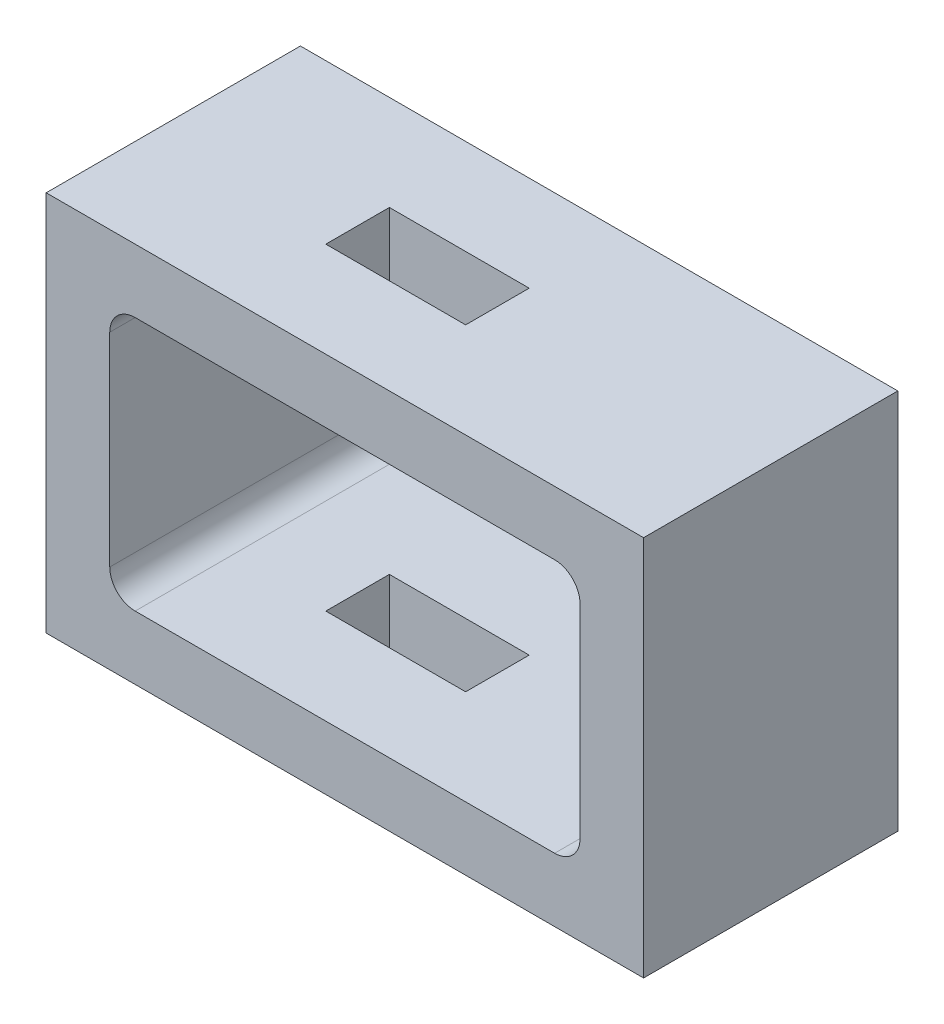
ISO-10303-21;
HEADER;
FILE_DESCRIPTION(('STEP AP214'),'2;1');
FILE_NAME('part.step','',(''),(''),'','','');
FILE_SCHEMA(('AUTOMOTIVE_DESIGN { 1 0 10303 214 1 1 1 1 }'));
ENDSEC;
DATA;
#1=APPLICATION_CONTEXT('core data for automotive mechanical design processes');
#2=APPLICATION_PROTOCOL_DEFINITION('international standard','automotive_design',2000,#1);
#3=PRODUCT_CONTEXT('',#1,'mechanical');
#4=PRODUCT('Part','Part','',(#3));
#5=PRODUCT_RELATED_PRODUCT_CATEGORY('part','',(#4));
#6=PRODUCT_DEFINITION_FORMATION('','',#4);
#7=PRODUCT_DEFINITION_CONTEXT('part definition',#1,'design');
#8=PRODUCT_DEFINITION('design','',#6,#7);
#9=PRODUCT_DEFINITION_SHAPE('','',#8);
#10=(LENGTH_UNIT() NAMED_UNIT(*) SI_UNIT(.MILLI.,.METRE.));
#11=(NAMED_UNIT(*) PLANE_ANGLE_UNIT() SI_UNIT($,.RADIAN.));
#12=(NAMED_UNIT(*) SI_UNIT($,.STERADIAN.) SOLID_ANGLE_UNIT());
#13=UNCERTAINTY_MEASURE_WITH_UNIT(LENGTH_MEASURE(1.E-05),#10,'distance_accuracy_value','');
#14=(GEOMETRIC_REPRESENTATION_CONTEXT(3) GLOBAL_UNCERTAINTY_ASSIGNED_CONTEXT((#13)) GLOBAL_UNIT_ASSIGNED_CONTEXT((#10,
#11,#12)) REPRESENTATION_CONTEXT('',''));
#15=CARTESIAN_POINT('',(0.,0.,0.));
#16=DIRECTION('',(0.,0.,1.));
#17=DIRECTION('',(1.,0.,0.));
#18=AXIS2_PLACEMENT_3D('',#15,#16,#17);
#19=CARTESIAN_POINT('',(-18.5,0.,20.));
#20=DIRECTION('',(1.,0.,0.));
#21=DIRECTION('',(0.,1.,0.));
#22=AXIS2_PLACEMENT_3D('',#19,#20,#21);
#23=PLANE('',#22);
#24=DIRECTION('',(0.,-1.,0.));
#25=VECTOR('',#24,1.);
#26=CARTESIAN_POINT('',(-18.5,0.,20.));
#27=LINE('',#26,#25);
#28=CARTESIAN_POINT('',(-18.5,8.,20.));
#29=VERTEX_POINT('',#28);
#30=CARTESIAN_POINT('',(-18.5,-8.,20.));
#31=VERTEX_POINT('',#30);
#32=EDGE_CURVE('E269',#29,#31,#27,.T.);
#33=ORIENTED_EDGE('',*,*,#32,.T.);
#34=DIRECTION('',(0.,0.,-1.));
#35=VECTOR('',#34,1.);
#36=CARTESIAN_POINT('',(-18.5,-8.,20.));
#37=LINE('',#36,#35);
#38=CARTESIAN_POINT('',(-18.5,-8.,0.));
#39=VERTEX_POINT('',#38);
#40=EDGE_CURVE('E305',#31,#39,#37,.T.);
#41=ORIENTED_EDGE('',*,*,#40,.T.);
#42=DIRECTION('',(0.,-1.,0.));
#43=VECTOR('',#42,1.);
#44=CARTESIAN_POINT('',(-18.5,0.,0.));
#45=LINE('',#44,#43);
#46=CARTESIAN_POINT('',(-18.5,8.,0.));
#47=VERTEX_POINT('',#46);
#48=EDGE_CURVE('E268',#47,#39,#45,.T.);
#49=ORIENTED_EDGE('',*,*,#48,.F.);
#50=DIRECTION('',(0.,0.,-1.));
#51=VECTOR('',#50,1.);
#52=CARTESIAN_POINT('',(-18.5,8.,20.));
#53=LINE('',#52,#51);
#54=EDGE_CURVE('E303',#47,#29,#53,.F.);
#55=ORIENTED_EDGE('',*,*,#54,.T.);
#56=EDGE_LOOP('',(#33,#41,#49,#55));
#57=FACE_BOUND('',#56,.T.);
#58=ADVANCED_FACE('F36',(#57),#23,.T.);
#59=CARTESIAN_POINT('',(0.,10.,20.));
#60=DIRECTION('',(0.,-1.,0.));
#61=DIRECTION('',(1.,0.,0.));
#62=AXIS2_PLACEMENT_3D('',#59,#60,#61);
#63=PLANE('',#62);
#64=DIRECTION('',(0.,0.,-1.));
#65=VECTOR('',#64,1.);
#66=CARTESIAN_POINT('',(-8.99999999999999,10.,20.));
#67=LINE('',#66,#65);
#68=CARTESIAN_POINT('',(-8.99999999999999,10.,12.5));
#69=VERTEX_POINT('',#68);
#70=CARTESIAN_POINT('',(-8.99999999999999,10.,7.5));
#71=VERTEX_POINT('',#70);
#72=EDGE_CURVE('E226',#69,#71,#67,.T.);
#73=ORIENTED_EDGE('',*,*,#72,.F.);
#74=DIRECTION('',(-1.,0.,0.));
#75=VECTOR('',#74,1.);
#76=CARTESIAN_POINT('',(0.,10.,12.5));
#77=LINE('',#76,#75);
#78=CARTESIAN_POINT('',(2.00000000000001,10.,12.5));
#79=VERTEX_POINT('',#78);
#80=EDGE_CURVE('E214',#79,#69,#77,.T.);
#81=ORIENTED_EDGE('',*,*,#80,.F.);
#82=DIRECTION('',(0.,0.,1.));
#83=VECTOR('',#82,1.);
#84=CARTESIAN_POINT('',(2.00000000000001,10.,20.));
#85=LINE('',#84,#83);
#86=CARTESIAN_POINT('',(2.00000000000001,10.,7.5));
#87=VERTEX_POINT('',#86);
#88=EDGE_CURVE('E222',#87,#79,#85,.T.);
#89=ORIENTED_EDGE('',*,*,#88,.F.);
#90=DIRECTION('',(1.,0.,0.));
#91=VECTOR('',#90,1.);
#92=CARTESIAN_POINT('',(0.,10.,7.5));
#93=LINE('',#92,#91);
#94=EDGE_CURVE('E224',#71,#87,#93,.T.);
#95=ORIENTED_EDGE('',*,*,#94,.F.);
#96=EDGE_LOOP('',(#73,#81,#89,#95));
#97=FACE_BOUND('',#96,.T.);
#98=DIRECTION('',(-1.,0.,0.));
#99=VECTOR('',#98,1.);
#100=CARTESIAN_POINT('',(0.,10.,20.));
#101=LINE('',#100,#99);
#102=CARTESIAN_POINT('',(16.5,10.,20.));
#103=VERTEX_POINT('',#102);
#104=CARTESIAN_POINT('',(-16.5,10.,20.));
#105=VERTEX_POINT('',#104);
#106=EDGE_CURVE('E272',#103,#105,#101,.T.);
#107=ORIENTED_EDGE('',*,*,#106,.T.);
#108=DIRECTION('',(0.,0.,-1.));
#109=VECTOR('',#108,1.);
#110=CARTESIAN_POINT('',(-16.5,10.,0.));
#111=LINE('',#110,#109);
#112=CARTESIAN_POINT('',(-16.5,10.,0.));
#113=VERTEX_POINT('',#112);
#114=EDGE_CURVE('E310',#105,#113,#111,.T.);
#115=ORIENTED_EDGE('',*,*,#114,.T.);
#116=DIRECTION('',(-1.,0.,0.));
#117=VECTOR('',#116,1.);
#118=CARTESIAN_POINT('',(0.,10.,0.));
#119=LINE('',#118,#117);
#120=CARTESIAN_POINT('',(16.5,10.,0.));
#121=VERTEX_POINT('',#120);
#122=EDGE_CURVE('E288',#121,#113,#119,.T.);
#123=ORIENTED_EDGE('',*,*,#122,.F.);
#124=DIRECTION('',(0.,0.,-1.));
#125=VECTOR('',#124,1.);
#126=CARTESIAN_POINT('',(16.5,10.,0.));
#127=LINE('',#126,#125);
#128=EDGE_CURVE('E255',#103,#121,#127,.T.);
#129=ORIENTED_EDGE('',*,*,#128,.F.);
#130=EDGE_LOOP('',(#107,#115,#123,#129));
#131=FACE_BOUND('',#130,.T.);
#132=ADVANCED_FACE('F348',(#97,#131),#63,.T.);
#133=CARTESIAN_POINT('',(0.,15.,20.));
#134=DIRECTION('',(0.,1.,0.));
#135=DIRECTION('',(0.,0.,1.));
#136=AXIS2_PLACEMENT_3D('',#133,#134,#135);
#137=PLANE('',#136);
#138=DIRECTION('',(0.,0.,1.));
#139=VECTOR('',#138,1.);
#140=CARTESIAN_POINT('',(-8.99999999999999,15.,7.5));
#141=LINE('',#140,#139);
#142=CARTESIAN_POINT('',(-8.99999999999999,15.,7.5));
#143=VERTEX_POINT('',#142);
#144=CARTESIAN_POINT('',(-8.99999999999999,15.,12.5));
#145=VERTEX_POINT('',#144);
#146=EDGE_CURVE('E59',#143,#145,#141,.T.);
#147=ORIENTED_EDGE('',*,*,#146,.F.);
#148=DIRECTION('',(-1.,0.,0.));
#149=VECTOR('',#148,1.);
#150=CARTESIAN_POINT('',(-8.99999999999999,15.,7.5));
#151=LINE('',#150,#149);
#152=CARTESIAN_POINT('',(2.00000000000001,15.,7.5));
#153=VERTEX_POINT('',#152);
#154=EDGE_CURVE('E199',#153,#143,#151,.T.);
#155=ORIENTED_EDGE('',*,*,#154,.F.);
#156=DIRECTION('',(0.,0.,-1.));
#157=VECTOR('',#156,1.);
#158=CARTESIAN_POINT('',(2.00000000000001,15.,7.5));
#159=LINE('',#158,#157);
#160=CARTESIAN_POINT('',(2.00000000000001,15.,12.5));
#161=VERTEX_POINT('',#160);
#162=EDGE_CURVE('E202',#161,#153,#159,.T.);
#163=ORIENTED_EDGE('',*,*,#162,.F.);
#164=DIRECTION('',(1.,0.,0.));
#165=VECTOR('',#164,1.);
#166=CARTESIAN_POINT('',(-8.99999999999999,15.,12.5));
#167=LINE('',#166,#165);
#168=EDGE_CURVE('E208',#145,#161,#167,.T.);
#169=ORIENTED_EDGE('',*,*,#168,.F.);
#170=EDGE_LOOP('',(#147,#155,#163,#169));
#171=FACE_BOUND('',#170,.T.);
#172=DIRECTION('',(1.,0.,0.));
#173=VECTOR('',#172,1.);
#174=CARTESIAN_POINT('',(0.,15.,0.));
#175=LINE('',#174,#173);
#176=CARTESIAN_POINT('',(-23.5,15.,0.));
#177=VERTEX_POINT('',#176);
#178=CARTESIAN_POINT('',(23.5,15.,0.));
#179=VERTEX_POINT('',#178);
#180=EDGE_CURVE('E291',#177,#179,#175,.T.);
#181=ORIENTED_EDGE('',*,*,#180,.F.);
#182=DIRECTION('',(0.,0.,-1.));
#183=VECTOR('',#182,1.);
#184=CARTESIAN_POINT('',(-23.5,15.,20.));
#185=LINE('',#184,#183);
#186=CARTESIAN_POINT('',(-23.5,15.,20.));
#187=VERTEX_POINT('',#186);
#188=EDGE_CURVE('E301',#187,#177,#185,.T.);
#189=ORIENTED_EDGE('',*,*,#188,.F.);
#190=DIRECTION('',(1.,0.,0.));
#191=VECTOR('',#190,1.);
#192=CARTESIAN_POINT('',(0.,15.,20.));
#193=LINE('',#192,#191);
#194=CARTESIAN_POINT('',(23.5,15.,20.));
#195=VERTEX_POINT('',#194);
#196=EDGE_CURVE('E276',#187,#195,#193,.T.);
#197=ORIENTED_EDGE('',*,*,#196,.T.);
#198=DIRECTION('',(0.,0.,-1.));
#199=VECTOR('',#198,1.);
#200=CARTESIAN_POINT('',(23.5,15.,20.));
#201=LINE('',#200,#199);
#202=EDGE_CURVE('E243',#195,#179,#201,.T.);
#203=ORIENTED_EDGE('',*,*,#202,.T.);
#204=EDGE_LOOP('',(#181,#189,#197,#203));
#205=FACE_BOUND('',#204,.T.);
#206=ADVANCED_FACE('F354',(#171,#205),#137,.T.);
#207=CARTESIAN_POINT('',(-23.5,0.,20.));
#208=DIRECTION('',(1.,0.,0.));
#209=DIRECTION('',(0.,0.,-1.));
#210=AXIS2_PLACEMENT_3D('',#207,#208,#209);
#211=PLANE('',#210);
#212=DIRECTION('',(0.,-1.,0.));
#213=VECTOR('',#212,1.);
#214=CARTESIAN_POINT('',(-23.5,0.,0.));
#215=LINE('',#214,#213);
#216=CARTESIAN_POINT('',(-23.5,-15.,0.));
#217=VERTEX_POINT('',#216);
#218=EDGE_CURVE('E293',#177,#217,#215,.T.);
#219=ORIENTED_EDGE('',*,*,#218,.T.);
#220=DIRECTION('',(0.,0.,-1.));
#221=VECTOR('',#220,1.);
#222=CARTESIAN_POINT('',(-23.5,-15.,20.));
#223=LINE('',#222,#221);
#224=CARTESIAN_POINT('',(-23.5,-15.,20.));
#225=VERTEX_POINT('',#224);
#226=EDGE_CURVE('E285',#225,#217,#223,.T.);
#227=ORIENTED_EDGE('',*,*,#226,.F.);
#228=DIRECTION('',(0.,-1.,0.));
#229=VECTOR('',#228,1.);
#230=CARTESIAN_POINT('',(-23.5,0.,20.));
#231=LINE('',#230,#229);
#232=EDGE_CURVE('E278',#187,#225,#231,.T.);
#233=ORIENTED_EDGE('',*,*,#232,.F.);
#234=ORIENTED_EDGE('',*,*,#188,.T.);
#235=EDGE_LOOP('',(#219,#227,#233,#234));
#236=FACE_BOUND('',#235,.T.);
#237=ADVANCED_FACE('F410',(#236),#211,.F.);
#238=CARTESIAN_POINT('',(0.,-15.,20.));
#239=DIRECTION('',(0.,1.,0.));
#240=DIRECTION('',(0.,0.,1.));
#241=AXIS2_PLACEMENT_3D('',#238,#239,#240);
#242=PLANE('',#241);
#243=DIRECTION('',(-1.,0.,0.));
#244=VECTOR('',#243,1.);
#245=CARTESIAN_POINT('',(-8.99999999999999,-15.,7.5));
#246=LINE('',#245,#244);
#247=CARTESIAN_POINT('',(2.00000000000001,-15.,7.5));
#248=VERTEX_POINT('',#247);
#249=CARTESIAN_POINT('',(-8.99999999999999,-15.,7.5));
#250=VERTEX_POINT('',#249);
#251=EDGE_CURVE('E198',#248,#250,#246,.T.);
#252=ORIENTED_EDGE('',*,*,#251,.T.);
#253=DIRECTION('',(0.,0.,1.));
#254=VECTOR('',#253,1.);
#255=CARTESIAN_POINT('',(-8.99999999999999,-15.,7.5));
#256=LINE('',#255,#254);
#257=CARTESIAN_POINT('',(-8.99999999999999,-15.,12.5));
#258=VERTEX_POINT('',#257);
#259=EDGE_CURVE('E179',#250,#258,#256,.T.);
#260=ORIENTED_EDGE('',*,*,#259,.T.);
#261=DIRECTION('',(1.,0.,0.));
#262=VECTOR('',#261,1.);
#263=CARTESIAN_POINT('',(-8.99999999999999,-15.,12.5));
#264=LINE('',#263,#262);
#265=CARTESIAN_POINT('',(2.00000000000001,-15.,12.5));
#266=VERTEX_POINT('',#265);
#267=EDGE_CURVE('E187',#258,#266,#264,.T.);
#268=ORIENTED_EDGE('',*,*,#267,.T.);
#269=DIRECTION('',(0.,0.,-1.));
#270=VECTOR('',#269,1.);
#271=CARTESIAN_POINT('',(2.00000000000001,-15.,7.5));
#272=LINE('',#271,#270);
#273=EDGE_CURVE('E193',#266,#248,#272,.T.);
#274=ORIENTED_EDGE('',*,*,#273,.T.);
#275=EDGE_LOOP('',(#252,#260,#268,#274));
#276=FACE_BOUND('',#275,.T.);
#277=DIRECTION('',(1.,0.,0.));
#278=VECTOR('',#277,1.);
#279=CARTESIAN_POINT('',(0.,-15.,0.));
#280=LINE('',#279,#278);
#281=CARTESIAN_POINT('',(23.5,-15.,0.));
#282=VERTEX_POINT('',#281);
#283=EDGE_CURVE('E295',#217,#282,#280,.T.);
#284=ORIENTED_EDGE('',*,*,#283,.T.);
#285=DIRECTION('',(0.,0.,-1.));
#286=VECTOR('',#285,1.);
#287=CARTESIAN_POINT('',(23.5,-15.,20.));
#288=LINE('',#287,#286);
#289=CARTESIAN_POINT('',(23.5,-15.,20.));
#290=VERTEX_POINT('',#289);
#291=EDGE_CURVE('E236',#290,#282,#288,.T.);
#292=ORIENTED_EDGE('',*,*,#291,.F.);
#293=DIRECTION('',(1.,0.,0.));
#294=VECTOR('',#293,1.);
#295=CARTESIAN_POINT('',(0.,-15.,20.));
#296=LINE('',#295,#294);
#297=EDGE_CURVE('E280',#225,#290,#296,.T.);
#298=ORIENTED_EDGE('',*,*,#297,.F.);
#299=ORIENTED_EDGE('',*,*,#226,.T.);
#300=EDGE_LOOP('',(#284,#292,#298,#299));
#301=FACE_BOUND('',#300,.T.);
#302=ADVANCED_FACE('F195',(#276,#301),#242,.F.);
#303=CARTESIAN_POINT('',(0.,-10.,20.));
#304=DIRECTION('',(0.,-1.,0.));
#305=DIRECTION('',(1.,0.,0.));
#306=AXIS2_PLACEMENT_3D('',#303,#304,#305);
#307=PLANE('',#306);
#308=DIRECTION('',(-1.,0.,0.));
#309=VECTOR('',#308,1.);
#310=CARTESIAN_POINT('',(0.,-10.,12.5));
#311=LINE('',#310,#309);
#312=CARTESIAN_POINT('',(2.00000000000001,-10.,12.5));
#313=VERTEX_POINT('',#312);
#314=CARTESIAN_POINT('',(-8.99999999999999,-10.,12.5));
#315=VERTEX_POINT('',#314);
#316=EDGE_CURVE('E321',#313,#315,#311,.T.);
#317=ORIENTED_EDGE('',*,*,#316,.T.);
#318=DIRECTION('',(0.,0.,-1.));
#319=VECTOR('',#318,1.);
#320=CARTESIAN_POINT('',(-8.99999999999999,-10.,20.));
#321=LINE('',#320,#319);
#322=CARTESIAN_POINT('',(-8.99999999999999,-10.,7.5));
#323=VERTEX_POINT('',#322);
#324=EDGE_CURVE('E11',#315,#323,#321,.T.);
#325=ORIENTED_EDGE('',*,*,#324,.T.);
#326=DIRECTION('',(1.,0.,0.));
#327=VECTOR('',#326,1.);
#328=CARTESIAN_POINT('',(0.,-10.,7.5));
#329=LINE('',#328,#327);
#330=CARTESIAN_POINT('',(2.00000000000001,-10.,7.5));
#331=VERTEX_POINT('',#330);
#332=EDGE_CURVE('E44',#323,#331,#329,.T.);
#333=ORIENTED_EDGE('',*,*,#332,.T.);
#334=DIRECTION('',(0.,0.,1.));
#335=VECTOR('',#334,1.);
#336=CARTESIAN_POINT('',(2.00000000000001,-10.,20.));
#337=LINE('',#336,#335);
#338=EDGE_CURVE('E323',#331,#313,#337,.T.);
#339=ORIENTED_EDGE('',*,*,#338,.T.);
#340=EDGE_LOOP('',(#317,#325,#333,#339));
#341=FACE_BOUND('',#340,.T.);
#342=DIRECTION('',(-1.,0.,0.));
#343=VECTOR('',#342,1.);
#344=CARTESIAN_POINT('',(0.,-10.,0.));
#345=LINE('',#344,#343);
#346=CARTESIAN_POINT('',(16.5,-10.,0.));
#347=VERTEX_POINT('',#346);
#348=CARTESIAN_POINT('',(-16.5,-10.,0.));
#349=VERTEX_POINT('',#348);
#350=EDGE_CURVE('E273',#347,#349,#345,.T.);
#351=ORIENTED_EDGE('',*,*,#350,.T.);
#352=DIRECTION('',(0.,0.,-1.));
#353=VECTOR('',#352,1.);
#354=CARTESIAN_POINT('',(-16.5,-10.,20.));
#355=LINE('',#354,#353);
#356=CARTESIAN_POINT('',(-16.5,-10.,20.));
#357=VERTEX_POINT('',#356);
#358=EDGE_CURVE('E308',#349,#357,#355,.F.);
#359=ORIENTED_EDGE('',*,*,#358,.T.);
#360=DIRECTION('',(-1.,0.,0.));
#361=VECTOR('',#360,1.);
#362=CARTESIAN_POINT('',(0.,-10.,20.));
#363=LINE('',#362,#361);
#364=CARTESIAN_POINT('',(16.5,-10.,20.));
#365=VERTEX_POINT('',#364);
#366=EDGE_CURVE('E282',#365,#357,#363,.T.);
#367=ORIENTED_EDGE('',*,*,#366,.F.);
#368=DIRECTION('',(0.,0.,-1.));
#369=VECTOR('',#368,1.);
#370=CARTESIAN_POINT('',(16.5,-10.,20.));
#371=LINE('',#370,#369);
#372=EDGE_CURVE('E252',#347,#365,#371,.F.);
#373=ORIENTED_EDGE('',*,*,#372,.F.);
#374=EDGE_LOOP('',(#351,#359,#367,#373));
#375=FACE_BOUND('',#374,.T.);
#376=ADVANCED_FACE('F327',(#341,#375),#307,.F.);
#377=CARTESIAN_POINT('',(0.,0.,20.));
#378=DIRECTION('',(0.,0.,1.));
#379=DIRECTION('',(1.,0.,0.));
#380=AXIS2_PLACEMENT_3D('',#377,#378,#379);
#381=PLANE('',#380);
#382=ORIENTED_EDGE('',*,*,#106,.F.);
#383=CARTESIAN_POINT('',(16.5,8.,20.));
#384=DIRECTION('',(0.,0.,-1.));
#385=DIRECTION('',(-1.,0.,0.));
#386=AXIS2_PLACEMENT_3D('',#383,#384,#385);
#387=CIRCLE('',#386,2.);
#388=CARTESIAN_POINT('',(18.5,8.,20.));
#389=VERTEX_POINT('',#388);
#390=EDGE_CURVE('E265',#389,#103,#387,.F.);
#391=ORIENTED_EDGE('',*,*,#390,.F.);
#392=DIRECTION('',(0.,-1.,0.));
#393=VECTOR('',#392,1.);
#394=CARTESIAN_POINT('',(18.5,0.,20.));
#395=LINE('',#394,#393);
#396=CARTESIAN_POINT('',(18.5,-8.,20.));
#397=VERTEX_POINT('',#396);
#398=EDGE_CURVE('E229',#389,#397,#395,.T.);
#399=ORIENTED_EDGE('',*,*,#398,.T.);
#400=CARTESIAN_POINT('',(16.5,-8.,20.));
#401=DIRECTION('',(0.,0.,-1.));
#402=DIRECTION('',(-1.,0.,0.));
#403=AXIS2_PLACEMENT_3D('',#400,#401,#402);
#404=CIRCLE('',#403,2.);
#405=EDGE_CURVE('E261',#365,#397,#404,.F.);
#406=ORIENTED_EDGE('',*,*,#405,.F.);
#407=ORIENTED_EDGE('',*,*,#366,.T.);
#408=CARTESIAN_POINT('',(-16.5,-8.,20.));
#409=DIRECTION('',(0.,0.,1.));
#410=DIRECTION('',(1.,0.,0.));
#411=AXIS2_PLACEMENT_3D('',#408,#409,#410);
#412=CIRCLE('',#411,2.);
#413=EDGE_CURVE('E315',#357,#31,#412,.F.);
#414=ORIENTED_EDGE('',*,*,#413,.T.);
#415=ORIENTED_EDGE('',*,*,#32,.F.);
#416=CARTESIAN_POINT('',(-16.5,8.,20.));
#417=DIRECTION('',(0.,0.,1.));
#418=DIRECTION('',(1.,0.,0.));
#419=AXIS2_PLACEMENT_3D('',#416,#417,#418);
#420=CIRCLE('',#419,2.);
#421=EDGE_CURVE('E319',#29,#105,#420,.F.);
#422=ORIENTED_EDGE('',*,*,#421,.T.);
#423=EDGE_LOOP('',(#382,#391,#399,#406,#407,#414,#415,#422));
#424=FACE_BOUND('',#423,.T.);
#425=DIRECTION('',(0.,-1.,0.));
#426=VECTOR('',#425,1.);
#427=CARTESIAN_POINT('',(23.5,0.,20.));
#428=LINE('',#427,#426);
#429=EDGE_CURVE('E232',#195,#290,#428,.T.);
#430=ORIENTED_EDGE('',*,*,#429,.F.);
#431=ORIENTED_EDGE('',*,*,#196,.F.);
#432=ORIENTED_EDGE('',*,*,#232,.T.);
#433=ORIENTED_EDGE('',*,*,#297,.T.);
#434=EDGE_LOOP('',(#430,#431,#432,#433));
#435=FACE_BOUND('',#434,.T.);
#436=ADVANCED_FACE('F368',(#424,#435),#381,.T.);
#437=CARTESIAN_POINT('',(0.,0.,0.));
#438=DIRECTION('',(0.,0.,1.));
#439=DIRECTION('',(1.,0.,0.));
#440=AXIS2_PLACEMENT_3D('',#437,#438,#439);
#441=PLANE('',#440);
#442=CARTESIAN_POINT('',(16.5,8.,0.));
#443=DIRECTION('',(0.,0.,-1.));
#444=DIRECTION('',(-1.,0.,0.));
#445=AXIS2_PLACEMENT_3D('',#442,#443,#444);
#446=CIRCLE('',#445,2.);
#447=CARTESIAN_POINT('',(18.5,8.,0.));
#448=VERTEX_POINT('',#447);
#449=EDGE_CURVE('E263',#121,#448,#446,.T.);
#450=ORIENTED_EDGE('',*,*,#449,.F.);
#451=ORIENTED_EDGE('',*,*,#122,.T.);
#452=CARTESIAN_POINT('',(-16.5,8.,0.));
#453=DIRECTION('',(0.,0.,1.));
#454=DIRECTION('',(1.,0.,0.));
#455=AXIS2_PLACEMENT_3D('',#452,#453,#454);
#456=CIRCLE('',#455,2.);
#457=EDGE_CURVE('E317',#113,#47,#456,.T.);
#458=ORIENTED_EDGE('',*,*,#457,.T.);
#459=ORIENTED_EDGE('',*,*,#48,.T.);
#460=CARTESIAN_POINT('',(-16.5,-8.,0.));
#461=DIRECTION('',(0.,0.,1.));
#462=DIRECTION('',(1.,0.,0.));
#463=AXIS2_PLACEMENT_3D('',#460,#461,#462);
#464=CIRCLE('',#463,2.);
#465=EDGE_CURVE('E313',#39,#349,#464,.T.);
#466=ORIENTED_EDGE('',*,*,#465,.T.);
#467=ORIENTED_EDGE('',*,*,#350,.F.);
#468=CARTESIAN_POINT('',(16.5,-8.,0.));
#469=DIRECTION('',(0.,0.,-1.));
#470=DIRECTION('',(-1.,0.,0.));
#471=AXIS2_PLACEMENT_3D('',#468,#469,#470);
#472=CIRCLE('',#471,2.);
#473=CARTESIAN_POINT('',(18.5,-8.,0.));
#474=VERTEX_POINT('',#473);
#475=EDGE_CURVE('E258',#474,#347,#472,.T.);
#476=ORIENTED_EDGE('',*,*,#475,.F.);
#477=DIRECTION('',(0.,-1.,0.));
#478=VECTOR('',#477,1.);
#479=CARTESIAN_POINT('',(18.5,0.,0.));
#480=LINE('',#479,#478);
#481=EDGE_CURVE('E228',#448,#474,#480,.T.);
#482=ORIENTED_EDGE('',*,*,#481,.F.);
#483=EDGE_LOOP('',(#450,#451,#458,#459,#466,#467,#476,#482));
#484=FACE_BOUND('',#483,.T.);
#485=ORIENTED_EDGE('',*,*,#180,.T.);
#486=DIRECTION('',(0.,-1.,0.));
#487=VECTOR('',#486,1.);
#488=CARTESIAN_POINT('',(23.5,0.,0.));
#489=LINE('',#488,#487);
#490=EDGE_CURVE('E233',#179,#282,#489,.T.);
#491=ORIENTED_EDGE('',*,*,#490,.T.);
#492=ORIENTED_EDGE('',*,*,#283,.F.);
#493=ORIENTED_EDGE('',*,*,#218,.F.);
#494=EDGE_LOOP('',(#485,#491,#492,#493));
#495=FACE_BOUND('',#494,.T.);
#496=ADVANCED_FACE('F360',(#484,#495),#441,.F.);
#497=CARTESIAN_POINT('',(-16.5,-8.,20.));
#498=DIRECTION('',(0.,0.,-1.));
#499=DIRECTION('',(-1.,0.,0.));
#500=AXIS2_PLACEMENT_3D('',#497,#498,#499);
#501=CYLINDRICAL_SURFACE('',#500,2.);
#502=ORIENTED_EDGE('',*,*,#413,.F.);
#503=ORIENTED_EDGE('',*,*,#358,.F.);
#504=ORIENTED_EDGE('',*,*,#465,.F.);
#505=ORIENTED_EDGE('',*,*,#40,.F.);
#506=EDGE_LOOP('',(#502,#503,#504,#505));
#507=FACE_BOUND('',#506,.T.);
#508=ADVANCED_FACE('F358',(#507),#501,.F.);
#509=CARTESIAN_POINT('',(-16.5,8.,20.));
#510=DIRECTION('',(0.,0.,1.));
#511=DIRECTION('',(1.,0.,0.));
#512=AXIS2_PLACEMENT_3D('',#509,#510,#511);
#513=CYLINDRICAL_SURFACE('',#512,2.);
#514=ORIENTED_EDGE('',*,*,#421,.F.);
#515=ORIENTED_EDGE('',*,*,#54,.F.);
#516=ORIENTED_EDGE('',*,*,#457,.F.);
#517=ORIENTED_EDGE('',*,*,#114,.F.);
#518=EDGE_LOOP('',(#514,#515,#516,#517));
#519=FACE_BOUND('',#518,.T.);
#520=ADVANCED_FACE('F38',(#519),#513,.F.);
#521=CARTESIAN_POINT('',(18.5,0.,20.));
#522=DIRECTION('',(-1.,0.,0.));
#523=DIRECTION('',(0.,1.,0.));
#524=AXIS2_PLACEMENT_3D('',#521,#522,#523);
#525=PLANE('',#524);
#526=ORIENTED_EDGE('',*,*,#398,.F.);
#527=DIRECTION('',(0.,0.,-1.));
#528=VECTOR('',#527,1.);
#529=CARTESIAN_POINT('',(18.5,8.,20.));
#530=LINE('',#529,#528);
#531=EDGE_CURVE('E246',#448,#389,#530,.F.);
#532=ORIENTED_EDGE('',*,*,#531,.F.);
#533=ORIENTED_EDGE('',*,*,#481,.T.);
#534=DIRECTION('',(0.,0.,-1.));
#535=VECTOR('',#534,1.);
#536=CARTESIAN_POINT('',(18.5,-8.,20.));
#537=LINE('',#536,#535);
#538=EDGE_CURVE('E249',#397,#474,#537,.T.);
#539=ORIENTED_EDGE('',*,*,#538,.F.);
#540=EDGE_LOOP('',(#526,#532,#533,#539));
#541=FACE_BOUND('',#540,.T.);
#542=ADVANCED_FACE('F366',(#541),#525,.T.);
#543=CARTESIAN_POINT('',(23.5,0.,20.));
#544=DIRECTION('',(-1.,0.,0.));
#545=DIRECTION('',(0.,0.,-1.));
#546=AXIS2_PLACEMENT_3D('',#543,#544,#545);
#547=PLANE('',#546);
#548=ORIENTED_EDGE('',*,*,#490,.F.);
#549=ORIENTED_EDGE('',*,*,#202,.F.);
#550=ORIENTED_EDGE('',*,*,#429,.T.);
#551=ORIENTED_EDGE('',*,*,#291,.T.);
#552=EDGE_LOOP('',(#548,#549,#550,#551));
#553=FACE_BOUND('',#552,.T.);
#554=ADVANCED_FACE('F402',(#553),#547,.F.);
#555=CARTESIAN_POINT('',(16.5,-8.,20.));
#556=DIRECTION('',(0.,0.,-1.));
#557=DIRECTION('',(1.,0.,0.));
#558=AXIS2_PLACEMENT_3D('',#555,#556,#557);
#559=CYLINDRICAL_SURFACE('',#558,2.);
#560=ORIENTED_EDGE('',*,*,#405,.T.);
#561=ORIENTED_EDGE('',*,*,#538,.T.);
#562=ORIENTED_EDGE('',*,*,#475,.T.);
#563=ORIENTED_EDGE('',*,*,#372,.T.);
#564=EDGE_LOOP('',(#560,#561,#562,#563));
#565=FACE_BOUND('',#564,.T.);
#566=ADVANCED_FACE('F392',(#565),#559,.F.);
#567=CARTESIAN_POINT('',(16.5,8.,20.));
#568=DIRECTION('',(0.,0.,1.));
#569=DIRECTION('',(-1.,0.,0.));
#570=AXIS2_PLACEMENT_3D('',#567,#568,#569);
#571=CYLINDRICAL_SURFACE('',#570,2.);
#572=ORIENTED_EDGE('',*,*,#390,.T.);
#573=ORIENTED_EDGE('',*,*,#128,.T.);
#574=ORIENTED_EDGE('',*,*,#449,.T.);
#575=ORIENTED_EDGE('',*,*,#531,.T.);
#576=EDGE_LOOP('',(#572,#573,#574,#575));
#577=FACE_BOUND('',#576,.T.);
#578=ADVANCED_FACE('F342',(#577),#571,.F.);
#579=CARTESIAN_POINT('',(-8.99999999999999,-15.,12.5));
#580=DIRECTION('',(0.,0.,1.));
#581=DIRECTION('',(1.,0.,0.));
#582=AXIS2_PLACEMENT_3D('',#579,#580,#581);
#583=PLANE('',#582);
#584=DIRECTION('',(0.,1.,0.));
#585=VECTOR('',#584,1.);
#586=CARTESIAN_POINT('',(2.00000000000001,-15.,12.5));
#587=LINE('',#586,#585);
#588=EDGE_CURVE('E190',#266,#313,#587,.T.);
#589=ORIENTED_EDGE('',*,*,#588,.F.);
#590=ORIENTED_EDGE('',*,*,#267,.F.);
#591=DIRECTION('',(0.,1.,0.));
#592=VECTOR('',#591,1.);
#593=CARTESIAN_POINT('',(-8.99999999999999,-15.,12.5));
#594=LINE('',#593,#592);
#595=EDGE_CURVE('E174',#258,#315,#594,.T.);
#596=ORIENTED_EDGE('',*,*,#595,.T.);
#597=ORIENTED_EDGE('',*,*,#316,.F.);
#598=EDGE_LOOP('',(#589,#590,#596,#597));
#599=FACE_BOUND('',#598,.T.);
#600=ADVANCED_FACE('F188',(#599),#583,.F.);
#601=CARTESIAN_POINT('',(2.00000000000001,-15.,7.5));
#602=DIRECTION('',(1.,0.,0.));
#603=DIRECTION('',(0.,0.,-1.));
#604=AXIS2_PLACEMENT_3D('',#601,#602,#603);
#605=PLANE('',#604);
#606=DIRECTION('',(0.,1.,0.));
#607=VECTOR('',#606,1.);
#608=CARTESIAN_POINT('',(2.00000000000001,-15.,7.5));
#609=LINE('',#608,#607);
#610=EDGE_CURVE('E216',#248,#331,#609,.T.);
#611=ORIENTED_EDGE('',*,*,#610,.F.);
#612=ORIENTED_EDGE('',*,*,#273,.F.);
#613=ORIENTED_EDGE('',*,*,#588,.T.);
#614=ORIENTED_EDGE('',*,*,#338,.F.);
#615=EDGE_LOOP('',(#611,#612,#613,#614));
#616=FACE_BOUND('',#615,.T.);
#617=ADVANCED_FACE('F332',(#616),#605,.F.);
#618=CARTESIAN_POINT('',(-8.99999999999999,-15.,7.5));
#619=DIRECTION('',(0.,0.,-1.));
#620=DIRECTION('',(-1.,0.,0.));
#621=AXIS2_PLACEMENT_3D('',#618,#619,#620);
#622=PLANE('',#621);
#623=DIRECTION('',(0.,1.,0.));
#624=VECTOR('',#623,1.);
#625=CARTESIAN_POINT('',(-8.99999999999999,-15.,7.5));
#626=LINE('',#625,#624);
#627=EDGE_CURVE('E212',#250,#323,#626,.T.);
#628=ORIENTED_EDGE('',*,*,#627,.F.);
#629=ORIENTED_EDGE('',*,*,#251,.F.);
#630=ORIENTED_EDGE('',*,*,#610,.T.);
#631=ORIENTED_EDGE('',*,*,#332,.F.);
#632=EDGE_LOOP('',(#628,#629,#630,#631));
#633=FACE_BOUND('',#632,.T.);
#634=ADVANCED_FACE('F330',(#633),#622,.F.);
#635=CARTESIAN_POINT('',(-8.99999999999999,-15.,7.5));
#636=DIRECTION('',(-1.,0.,0.));
#637=DIRECTION('',(0.,0.,1.));
#638=AXIS2_PLACEMENT_3D('',#635,#636,#637);
#639=PLANE('',#638);
#640=ORIENTED_EDGE('',*,*,#595,.F.);
#641=ORIENTED_EDGE('',*,*,#259,.F.);
#642=ORIENTED_EDGE('',*,*,#627,.T.);
#643=ORIENTED_EDGE('',*,*,#324,.F.);
#644=EDGE_LOOP('',(#640,#641,#642,#643));
#645=FACE_BOUND('',#644,.T.);
#646=ADVANCED_FACE('F176',(#645),#639,.F.);
#647=ORIENTED_EDGE('',*,*,#72,.T.);
#648=EDGE_CURVE('E215',#71,#143,#626,.T.);
#649=ORIENTED_EDGE('',*,*,#648,.T.);
#650=ORIENTED_EDGE('',*,*,#146,.T.);
#651=EDGE_CURVE('E183',#69,#145,#594,.T.);
#652=ORIENTED_EDGE('',*,*,#651,.F.);
#653=EDGE_LOOP('',(#647,#649,#650,#652));
#654=FACE_BOUND('',#653,.T.);
#655=ADVANCED_FACE('F432',(#654),#639,.F.);
#656=ORIENTED_EDGE('',*,*,#94,.T.);
#657=EDGE_CURVE('E219',#87,#153,#609,.T.);
#658=ORIENTED_EDGE('',*,*,#657,.T.);
#659=ORIENTED_EDGE('',*,*,#154,.T.);
#660=ORIENTED_EDGE('',*,*,#648,.F.);
#661=EDGE_LOOP('',(#656,#658,#659,#660));
#662=FACE_BOUND('',#661,.T.);
#663=ADVANCED_FACE('F341',(#662),#622,.F.);
#664=ORIENTED_EDGE('',*,*,#88,.T.);
#665=EDGE_CURVE('E51',#79,#161,#587,.T.);
#666=ORIENTED_EDGE('',*,*,#665,.T.);
#667=ORIENTED_EDGE('',*,*,#162,.T.);
#668=ORIENTED_EDGE('',*,*,#657,.F.);
#669=EDGE_LOOP('',(#664,#666,#667,#668));
#670=FACE_BOUND('',#669,.T.);
#671=ADVANCED_FACE('F335',(#670),#605,.F.);
#672=ORIENTED_EDGE('',*,*,#80,.T.);
#673=ORIENTED_EDGE('',*,*,#651,.T.);
#674=ORIENTED_EDGE('',*,*,#168,.T.);
#675=ORIENTED_EDGE('',*,*,#665,.F.);
#676=EDGE_LOOP('',(#672,#673,#674,#675));
#677=FACE_BOUND('',#676,.T.);
#678=ADVANCED_FACE('F344',(#677),#583,.F.);
#679=CLOSED_SHELL('',(#58,#132,#206,#237,#302,#376,#436,#496,#508,#520,#542,#554,#566,#578,#600,
#617,#634,#646,#655,#663,#671,#678));
#680=MANIFOLD_SOLID_BREP('B2',#679);
#681=ADVANCED_BREP_SHAPE_REPRESENTATION('',(#18,#680),#14);
#682=SHAPE_DEFINITION_REPRESENTATION(#9,#681);
ENDSEC;
END-ISO-10303-21;
